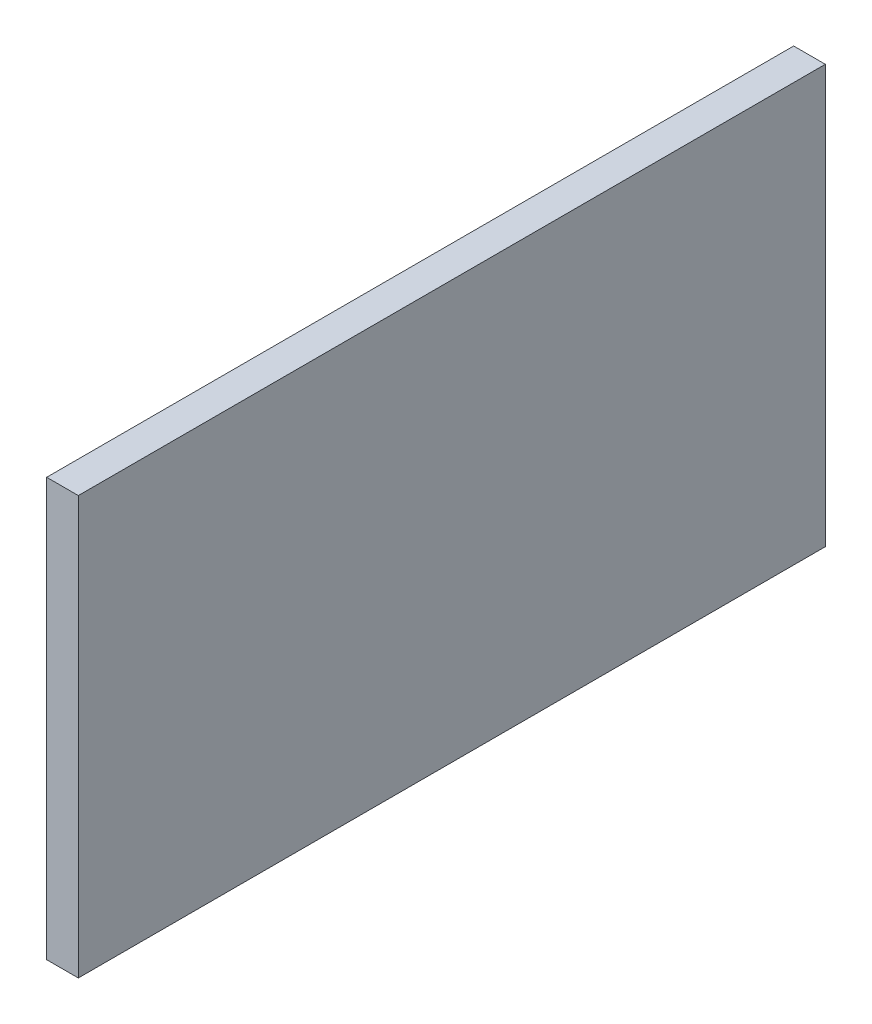
ISO-10303-21;
HEADER;
FILE_DESCRIPTION(('STEP AP214'),'2;1');
FILE_NAME('part.step','',(''),(''),'','','');
FILE_SCHEMA(('AUTOMOTIVE_DESIGN { 1 0 10303 214 1 1 1 1 }'));
ENDSEC;
DATA;
#1=APPLICATION_CONTEXT('core data for automotive mechanical design processes');
#2=APPLICATION_PROTOCOL_DEFINITION('international standard','automotive_design',2000,#1);
#3=PRODUCT_CONTEXT('',#1,'mechanical');
#4=PRODUCT('Part','Part','',(#3));
#5=PRODUCT_RELATED_PRODUCT_CATEGORY('part','',(#4));
#6=PRODUCT_DEFINITION_FORMATION('','',#4);
#7=PRODUCT_DEFINITION_CONTEXT('part definition',#1,'design');
#8=PRODUCT_DEFINITION('design','',#6,#7);
#9=PRODUCT_DEFINITION_SHAPE('','',#8);
#10=(LENGTH_UNIT() NAMED_UNIT(*) SI_UNIT(.MILLI.,.METRE.));
#11=(NAMED_UNIT(*) PLANE_ANGLE_UNIT() SI_UNIT($,.RADIAN.));
#12=(NAMED_UNIT(*) SI_UNIT($,.STERADIAN.) SOLID_ANGLE_UNIT());
#13=UNCERTAINTY_MEASURE_WITH_UNIT(LENGTH_MEASURE(1.E-05),#10,'distance_accuracy_value','');
#14=(GEOMETRIC_REPRESENTATION_CONTEXT(3) GLOBAL_UNCERTAINTY_ASSIGNED_CONTEXT((#13)) GLOBAL_UNIT_ASSIGNED_CONTEXT((#10,
#11,#12)) REPRESENTATION_CONTEXT('',''));
#15=CARTESIAN_POINT('',(0.,0.,0.));
#16=DIRECTION('',(0.,0.,1.));
#17=DIRECTION('',(1.,0.,0.));
#18=AXIS2_PLACEMENT_3D('',#15,#16,#17);
#19=CARTESIAN_POINT('',(3.175,-20.955,-37.465));
#20=DIRECTION('',(0.,0.,1.));
#21=DIRECTION('',(1.,0.,0.));
#22=AXIS2_PLACEMENT_3D('',#19,#20,#21);
#23=PLANE('',#22);
#24=DIRECTION('',(0.,1.,0.));
#25=VECTOR('',#24,1.);
#26=CARTESIAN_POINT('',(0.,-20.955,-37.465));
#27=LINE('',#26,#25);
#28=CARTESIAN_POINT('',(0.,-20.955,-37.465));
#29=VERTEX_POINT('',#28);
#30=CARTESIAN_POINT('',(0.,20.955,-37.465));
#31=VERTEX_POINT('',#30);
#32=EDGE_CURVE('E95',#29,#31,#27,.T.);
#33=ORIENTED_EDGE('',*,*,#32,.T.);
#34=DIRECTION('',(-1.,0.,0.));
#35=VECTOR('',#34,1.);
#36=CARTESIAN_POINT('',(3.175,20.955,-37.465));
#37=LINE('',#36,#35);
#38=CARTESIAN_POINT('',(3.175,20.955,-37.465));
#39=VERTEX_POINT('',#38);
#40=EDGE_CURVE('E11',#39,#31,#37,.T.);
#41=ORIENTED_EDGE('',*,*,#40,.F.);
#42=DIRECTION('',(0.,1.,0.));
#43=VECTOR('',#42,1.);
#44=CARTESIAN_POINT('',(3.175,-20.955,-37.465));
#45=LINE('',#44,#43);
#46=CARTESIAN_POINT('',(3.175,-20.955,-37.465));
#47=VERTEX_POINT('',#46);
#48=EDGE_CURVE('E83',#47,#39,#45,.T.);
#49=ORIENTED_EDGE('',*,*,#48,.F.);
#50=DIRECTION('',(-1.,0.,0.));
#51=VECTOR('',#50,1.);
#52=CARTESIAN_POINT('',(3.175,-20.955,-37.465));
#53=LINE('',#52,#51);
#54=EDGE_CURVE('E91',#47,#29,#53,.T.);
#55=ORIENTED_EDGE('',*,*,#54,.T.);
#56=EDGE_LOOP('',(#33,#41,#49,#55));
#57=FACE_BOUND('',#56,.T.);
#58=ADVANCED_FACE('F32',(#57),#23,.F.);
#59=CARTESIAN_POINT('',(3.175,20.955,37.465));
#60=DIRECTION('',(0.,-1.,0.));
#61=DIRECTION('',(0.,0.,-1.));
#62=AXIS2_PLACEMENT_3D('',#59,#60,#61);
#63=PLANE('',#62);
#64=DIRECTION('',(0.,0.,1.));
#65=VECTOR('',#64,1.);
#66=CARTESIAN_POINT('',(0.,20.955,37.465));
#67=LINE('',#66,#65);
#68=CARTESIAN_POINT('',(0.,20.955,37.465));
#69=VERTEX_POINT('',#68);
#70=EDGE_CURVE('E87',#31,#69,#67,.T.);
#71=ORIENTED_EDGE('',*,*,#70,.T.);
#72=DIRECTION('',(-1.,0.,0.));
#73=VECTOR('',#72,1.);
#74=CARTESIAN_POINT('',(3.175,20.955,37.465));
#75=LINE('',#74,#73);
#76=CARTESIAN_POINT('',(3.175,20.955,37.465));
#77=VERTEX_POINT('',#76);
#78=EDGE_CURVE('E40',#77,#69,#75,.T.);
#79=ORIENTED_EDGE('',*,*,#78,.F.);
#80=DIRECTION('',(0.,0.,1.));
#81=VECTOR('',#80,1.);
#82=CARTESIAN_POINT('',(3.175,20.955,37.465));
#83=LINE('',#82,#81);
#84=EDGE_CURVE('E78',#39,#77,#83,.T.);
#85=ORIENTED_EDGE('',*,*,#84,.F.);
#86=ORIENTED_EDGE('',*,*,#40,.T.);
#87=EDGE_LOOP('',(#71,#79,#85,#86));
#88=FACE_BOUND('',#87,.T.);
#89=ADVANCED_FACE('F86',(#88),#63,.F.);
#90=CARTESIAN_POINT('',(3.175,-20.955,37.465));
#91=DIRECTION('',(0.,0.,-1.));
#92=DIRECTION('',(-1.,0.,0.));
#93=AXIS2_PLACEMENT_3D('',#90,#91,#92);
#94=PLANE('',#93);
#95=DIRECTION('',(0.,-1.,0.));
#96=VECTOR('',#95,1.);
#97=CARTESIAN_POINT('',(0.,-20.955,37.465));
#98=LINE('',#97,#96);
#99=CARTESIAN_POINT('',(0.,-20.955,37.465));
#100=VERTEX_POINT('',#99);
#101=EDGE_CURVE('E65',#69,#100,#98,.T.);
#102=ORIENTED_EDGE('',*,*,#101,.T.);
#103=DIRECTION('',(-1.,0.,0.));
#104=VECTOR('',#103,1.);
#105=CARTESIAN_POINT('',(3.175,-20.955,37.465));
#106=LINE('',#105,#104);
#107=CARTESIAN_POINT('',(3.175,-20.955,37.465));
#108=VERTEX_POINT('',#107);
#109=EDGE_CURVE('E88',#108,#100,#106,.T.);
#110=ORIENTED_EDGE('',*,*,#109,.F.);
#111=DIRECTION('',(0.,-1.,0.));
#112=VECTOR('',#111,1.);
#113=CARTESIAN_POINT('',(3.175,-20.955,37.465));
#114=LINE('',#113,#112);
#115=EDGE_CURVE('E81',#77,#108,#114,.T.);
#116=ORIENTED_EDGE('',*,*,#115,.F.);
#117=ORIENTED_EDGE('',*,*,#78,.T.);
#118=EDGE_LOOP('',(#102,#110,#116,#117));
#119=FACE_BOUND('',#118,.T.);
#120=ADVANCED_FACE('F89',(#119),#94,.F.);
#121=CARTESIAN_POINT('',(3.175,-20.955,37.465));
#122=DIRECTION('',(0.,1.,0.));
#123=DIRECTION('',(0.,0.,1.));
#124=AXIS2_PLACEMENT_3D('',#121,#122,#123);
#125=PLANE('',#124);
#126=DIRECTION('',(0.,0.,-1.));
#127=VECTOR('',#126,1.);
#128=CARTESIAN_POINT('',(0.,-20.955,37.465));
#129=LINE('',#128,#127);
#130=EDGE_CURVE('E71',#100,#29,#129,.T.);
#131=ORIENTED_EDGE('',*,*,#130,.T.);
#132=ORIENTED_EDGE('',*,*,#54,.F.);
#133=DIRECTION('',(0.,0.,-1.));
#134=VECTOR('',#133,1.);
#135=CARTESIAN_POINT('',(3.175,-20.955,37.465));
#136=LINE('',#135,#134);
#137=EDGE_CURVE('E48',#108,#47,#136,.T.);
#138=ORIENTED_EDGE('',*,*,#137,.F.);
#139=ORIENTED_EDGE('',*,*,#109,.T.);
#140=EDGE_LOOP('',(#131,#132,#138,#139));
#141=FACE_BOUND('',#140,.T.);
#142=ADVANCED_FACE('F102',(#141),#125,.F.);
#143=CARTESIAN_POINT('',(3.175,20.955,-37.465));
#144=DIRECTION('',(-1.,0.,0.));
#145=DIRECTION('',(0.,0.,1.));
#146=AXIS2_PLACEMENT_3D('',#143,#144,#145);
#147=PLANE('',#146);
#148=ORIENTED_EDGE('',*,*,#48,.T.);
#149=ORIENTED_EDGE('',*,*,#84,.T.);
#150=ORIENTED_EDGE('',*,*,#115,.T.);
#151=ORIENTED_EDGE('',*,*,#137,.T.);
#152=EDGE_LOOP('',(#148,#149,#150,#151));
#153=FACE_BOUND('',#152,.T.);
#154=ADVANCED_FACE('F79',(#153),#147,.F.);
#155=CARTESIAN_POINT('',(0.,20.955,-37.465));
#156=DIRECTION('',(-1.,0.,0.));
#157=DIRECTION('',(0.,0.,1.));
#158=AXIS2_PLACEMENT_3D('',#155,#156,#157);
#159=PLANE('',#158);
#160=ORIENTED_EDGE('',*,*,#32,.F.);
#161=ORIENTED_EDGE('',*,*,#130,.F.);
#162=ORIENTED_EDGE('',*,*,#101,.F.);
#163=ORIENTED_EDGE('',*,*,#70,.F.);
#164=EDGE_LOOP('',(#160,#161,#162,#163));
#165=FACE_BOUND('',#164,.T.);
#166=ADVANCED_FACE('F105',(#165),#159,.T.);
#167=CLOSED_SHELL('',(#58,#89,#120,#142,#154,#166));
#168=MANIFOLD_SOLID_BREP('B2',#167);
#169=ADVANCED_BREP_SHAPE_REPRESENTATION('',(#18,#168),#14);
#170=SHAPE_DEFINITION_REPRESENTATION(#9,#169);
ENDSEC;
END-ISO-10303-21;
